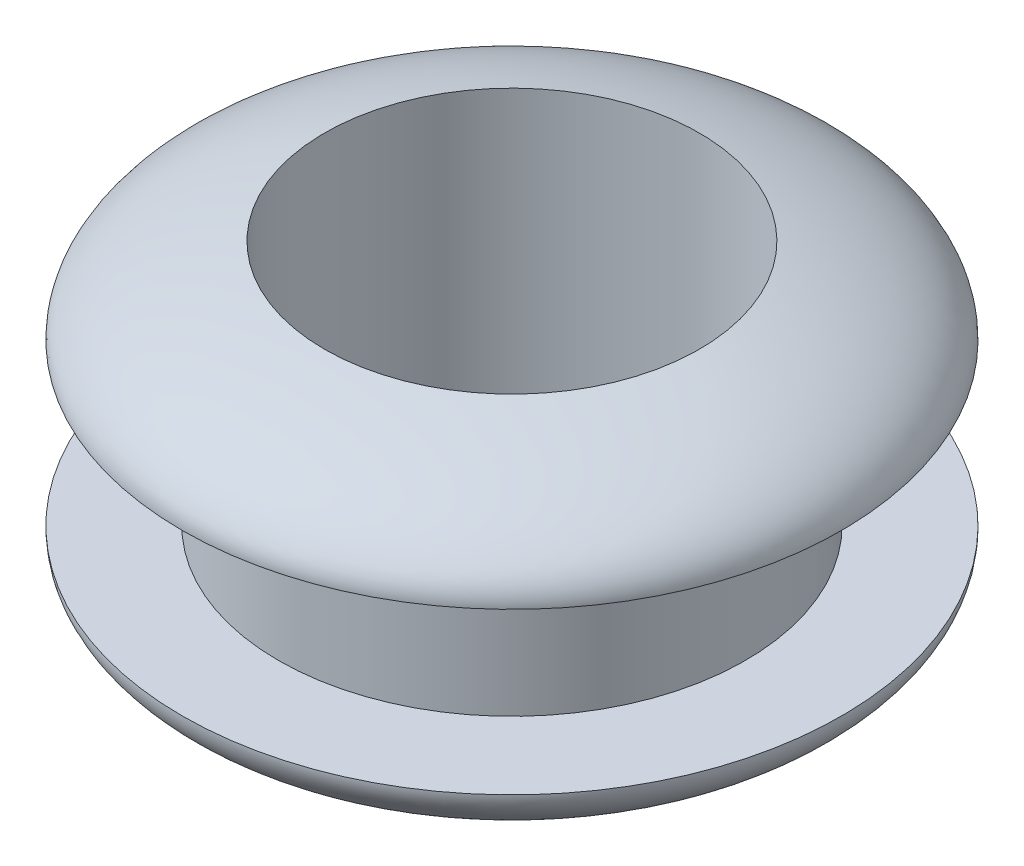
ISO-10303-21;
HEADER;
FILE_DESCRIPTION(('STEP AP214'),'2;1');
FILE_NAME('part.step','',(''),(''),'','','');
FILE_SCHEMA(('AUTOMOTIVE_DESIGN { 1 0 10303 214 1 1 1 1 }'));
ENDSEC;
DATA;
#1=APPLICATION_CONTEXT('core data for automotive mechanical design processes');
#2=APPLICATION_PROTOCOL_DEFINITION('international standard','automotive_design',2000,#1);
#3=PRODUCT_CONTEXT('',#1,'mechanical');
#4=PRODUCT('Part','Part','',(#3));
#5=PRODUCT_RELATED_PRODUCT_CATEGORY('part','',(#4));
#6=PRODUCT_DEFINITION_FORMATION('','',#4);
#7=PRODUCT_DEFINITION_CONTEXT('part definition',#1,'design');
#8=PRODUCT_DEFINITION('design','',#6,#7);
#9=PRODUCT_DEFINITION_SHAPE('','',#8);
#10=(LENGTH_UNIT() NAMED_UNIT(*) SI_UNIT(.MILLI.,.METRE.));
#11=(NAMED_UNIT(*) PLANE_ANGLE_UNIT() SI_UNIT($,.RADIAN.));
#12=(NAMED_UNIT(*) SI_UNIT($,.STERADIAN.) SOLID_ANGLE_UNIT());
#13=UNCERTAINTY_MEASURE_WITH_UNIT(LENGTH_MEASURE(1.E-05),#10,'distance_accuracy_value','');
#14=(GEOMETRIC_REPRESENTATION_CONTEXT(3) GLOBAL_UNCERTAINTY_ASSIGNED_CONTEXT((#13)) GLOBAL_UNIT_ASSIGNED_CONTEXT((#10,
#11,#12)) REPRESENTATION_CONTEXT('',''));
#15=CARTESIAN_POINT('',(0.,0.,0.));
#16=DIRECTION('',(0.,0.,1.));
#17=DIRECTION('',(1.,0.,0.));
#18=AXIS2_PLACEMENT_3D('',#15,#16,#17);
#19=CARTESIAN_POINT('',(0.,1.5,-4.36));
#20=DIRECTION('',(0.,1.,0.));
#21=DIRECTION('',(0.,0.,1.));
#22=AXIS2_PLACEMENT_3D('',#19,#20,#21);
#23=PLANE('',#22);
#24=CARTESIAN_POINT('',(0.,1.5,0.));
#25=DIRECTION('',(0.,1.,0.));
#26=DIRECTION('',(0.,0.,1.));
#27=AXIS2_PLACEMENT_3D('',#24,#25,#26);
#28=CIRCLE('',#27,6.15549368063552);
#29=CARTESIAN_POINT('',(0.,1.5,6.15549368063552));
#30=VERTEX_POINT('',#29);
#31=EDGE_CURVE('E10',#30,#30,#28,.T.);
#32=ORIENTED_EDGE('',*,*,#31,.F.);
#33=EDGE_LOOP('',(#32));
#34=FACE_BOUND('',#33,.T.);
#35=CARTESIAN_POINT('',(0.,1.5,0.));
#36=DIRECTION('',(0.,1.,0.));
#37=DIRECTION('',(0.,0.,1.));
#38=AXIS2_PLACEMENT_3D('',#35,#36,#37);
#39=CIRCLE('',#38,4.36);
#40=CARTESIAN_POINT('',(0.,1.5,4.36));
#41=VERTEX_POINT('',#40);
#42=EDGE_CURVE('E49',#41,#41,#39,.T.);
#43=ORIENTED_EDGE('',*,*,#42,.T.);
#44=EDGE_LOOP('',(#43));
#45=FACE_BOUND('',#44,.T.);
#46=ADVANCED_FACE('F33',(#34,#45),#23,.F.);
#47=CARTESIAN_POINT('',(0.,1.62302624620939,0.));
#48=DIRECTION('',(1.,0.,0.));
#49=DIRECTION('',(0.,-0.0199824235256819,-0.999800331441254));
#50=AXIS2_PLACEMENT_3D('',#47,#48,#49);
#51=ELLIPSE('',#50,6.15672298464046,1.87663380421679);
#52=TRIMMED_CURVE('',#51,(PARAMETER_VALUE(-1.56470433328115)),
(PARAMETER_VALUE(1.57688832030864)),.T.,.PARAMETER.);
#53=CARTESIAN_POINT('',(0.,6.51634908764229,0.));
#54=DIRECTION('',(0.,1.,0.));
#55=AXIS1_PLACEMENT('',#53,#54);
#56=SURFACE_OF_REVOLUTION('',#52,#55);
#57=CARTESIAN_POINT('',(0.,3.1036171410405,0.));
#58=DIRECTION('',(0.,1.,0.));
#59=DIRECTION('',(0.,0.,1.));
#60=AXIS2_PLACEMENT_3D('',#57,#58,#59);
#61=CIRCLE('',#60,3.5);
#62=CARTESIAN_POINT('',(0.,3.1036171410405,3.5));
#63=VERTEX_POINT('',#62);
#64=EDGE_CURVE('E52',#63,#63,#61,.F.);
#65=ORIENTED_EDGE('',*,*,#64,.T.);
#66=EDGE_LOOP('',(#65));
#67=FACE_BOUND('',#66,.T.);
#68=ORIENTED_EDGE('',*,*,#31,.T.);
#69=EDGE_LOOP('',(#68));
#70=FACE_BOUND('',#69,.T.);
#71=ADVANCED_FACE('F62',(#67,#70),#56,.T.);
#72=CARTESIAN_POINT('',(0.,-1.62302624620939,0.));
#73=DIRECTION('',(1.,0.,0.));
#74=DIRECTION('',(0.,0.0199824235256819,-0.999800331441254));
#75=AXIS2_PLACEMENT_3D('',#72,#73,#74);
#76=ELLIPSE('',#75,6.15672298464046,1.87663380421679);
#77=TRIMMED_CURVE('',#76,(PARAMETER_VALUE(4.70629698687094)),
(PARAMETER_VALUE(7.84788964046074)),.T.,.PARAMETER.);
#78=CARTESIAN_POINT('',(0.,6.51634908764229,0.));
#79=DIRECTION('',(0.,1.,0.));
#80=AXIS1_PLACEMENT('',#78,#79);
#81=SURFACE_OF_REVOLUTION('',#77,#80);
#82=CARTESIAN_POINT('',(0.,-3.1036171410405,0.));
#83=DIRECTION('',(0.,1.,0.));
#84=DIRECTION('',(0.,0.,1.));
#85=AXIS2_PLACEMENT_3D('',#82,#83,#84);
#86=CIRCLE('',#85,3.5);
#87=CARTESIAN_POINT('',(0.,-3.1036171410405,3.5));
#88=VERTEX_POINT('',#87);
#89=EDGE_CURVE('E36',#88,#88,#86,.T.);
#90=ORIENTED_EDGE('',*,*,#89,.T.);
#91=EDGE_LOOP('',(#90));
#92=FACE_BOUND('',#91,.T.);
#93=CARTESIAN_POINT('',(0.,-1.5,0.));
#94=DIRECTION('',(0.,1.,0.));
#95=DIRECTION('',(0.,0.,1.));
#96=AXIS2_PLACEMENT_3D('',#93,#94,#95);
#97=CIRCLE('',#96,6.15549368063551);
#98=CARTESIAN_POINT('',(0.,-1.5,6.15549368063551));
#99=VERTEX_POINT('',#98);
#100=EDGE_CURVE('E40',#99,#99,#97,.T.);
#101=ORIENTED_EDGE('',*,*,#100,.F.);
#102=EDGE_LOOP('',(#101));
#103=FACE_BOUND('',#102,.T.);
#104=ADVANCED_FACE('F58',(#92,#103),#81,.T.);
#105=CARTESIAN_POINT('',(0.,-1.5,-4.36));
#106=DIRECTION('',(0.,-1.,0.));
#107=DIRECTION('',(0.,0.,-1.));
#108=AXIS2_PLACEMENT_3D('',#105,#106,#107);
#109=PLANE('',#108);
#110=CARTESIAN_POINT('',(0.,-1.5,0.));
#111=DIRECTION('',(0.,1.,0.));
#112=DIRECTION('',(0.,0.,1.));
#113=AXIS2_PLACEMENT_3D('',#110,#111,#112);
#114=CIRCLE('',#113,4.36);
#115=CARTESIAN_POINT('',(0.,-1.5,4.36));
#116=VERTEX_POINT('',#115);
#117=EDGE_CURVE('E44',#116,#116,#114,.T.);
#118=ORIENTED_EDGE('',*,*,#117,.F.);
#119=EDGE_LOOP('',(#118));
#120=FACE_BOUND('',#119,.T.);
#121=ORIENTED_EDGE('',*,*,#100,.T.);
#122=EDGE_LOOP('',(#121));
#123=FACE_BOUND('',#122,.T.);
#124=ADVANCED_FACE('F61',(#120,#123),#109,.F.);
#125=CARTESIAN_POINT('',(0.,6.51634908764229,0.));
#126=DIRECTION('',(0.,1.,0.));
#127=DIRECTION('',(0.,0.,1.));
#128=AXIS2_PLACEMENT_3D('',#125,#126,#127);
#129=CYLINDRICAL_SURFACE('',#128,4.36);
#130=ORIENTED_EDGE('',*,*,#42,.F.);
#131=EDGE_LOOP('',(#130));
#132=FACE_BOUND('',#131,.T.);
#133=ORIENTED_EDGE('',*,*,#117,.T.);
#134=EDGE_LOOP('',(#133));
#135=FACE_BOUND('',#134,.T.);
#136=ADVANCED_FACE('F80',(#132,#135),#129,.T.);
#137=CARTESIAN_POINT('',(0.,-3.5,0.));
#138=DIRECTION('',(0.,1.,0.));
#139=DIRECTION('',(0.,0.,1.));
#140=AXIS2_PLACEMENT_3D('',#137,#138,#139);
#141=CYLINDRICAL_SURFACE('',#140,3.5);
#142=ORIENTED_EDGE('',*,*,#89,.F.);
#143=EDGE_LOOP('',(#142));
#144=FACE_BOUND('',#143,.T.);
#145=ORIENTED_EDGE('',*,*,#64,.F.);
#146=EDGE_LOOP('',(#145));
#147=FACE_BOUND('',#146,.T.);
#148=ADVANCED_FACE('F78',(#144,#147),#141,.F.);
#149=CLOSED_SHELL('',(#46,#71,#104,#124,#136,#148));
#150=MANIFOLD_SOLID_BREP('B2',#149);
#151=ADVANCED_BREP_SHAPE_REPRESENTATION('',(#18,#150),#14);
#152=SHAPE_DEFINITION_REPRESENTATION(#9,#151);
ENDSEC;
END-ISO-10303-21;
